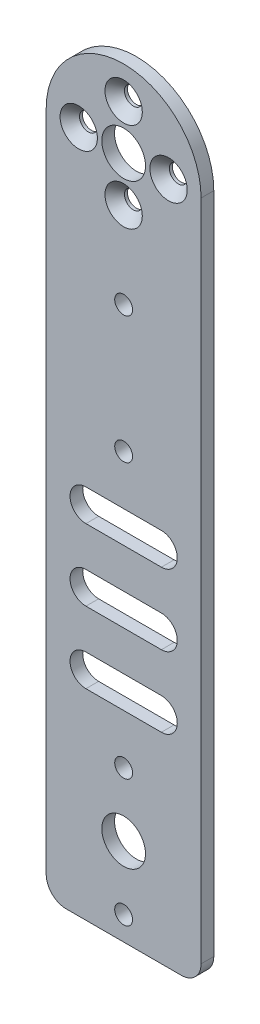
ISO-10303-21;
HEADER;
FILE_DESCRIPTION(('STEP AP214'),'2;1');
FILE_NAME('part.step','',(''),(''),'','','');
FILE_SCHEMA(('AUTOMOTIVE_DESIGN { 1 0 10303 214 1 1 1 1 }'));
ENDSEC;
DATA;
#1=APPLICATION_CONTEXT('core data for automotive mechanical design processes');
#2=APPLICATION_PROTOCOL_DEFINITION('international standard','automotive_design',2000,#1);
#3=PRODUCT_CONTEXT('',#1,'mechanical');
#4=PRODUCT('Part','Part','',(#3));
#5=PRODUCT_RELATED_PRODUCT_CATEGORY('part','',(#4));
#6=PRODUCT_DEFINITION_FORMATION('','',#4);
#7=PRODUCT_DEFINITION_CONTEXT('part definition',#1,'design');
#8=PRODUCT_DEFINITION('design','',#6,#7);
#9=PRODUCT_DEFINITION_SHAPE('','',#8);
#10=(LENGTH_UNIT() NAMED_UNIT(*) SI_UNIT(.MILLI.,.METRE.));
#11=(NAMED_UNIT(*) PLANE_ANGLE_UNIT() SI_UNIT($,.RADIAN.));
#12=(NAMED_UNIT(*) SI_UNIT($,.STERADIAN.) SOLID_ANGLE_UNIT());
#13=UNCERTAINTY_MEASURE_WITH_UNIT(LENGTH_MEASURE(1.E-05),#10,'distance_accuracy_value','');
#14=(GEOMETRIC_REPRESENTATION_CONTEXT(3) GLOBAL_UNCERTAINTY_ASSIGNED_CONTEXT((#13)) GLOBAL_UNIT_ASSIGNED_CONTEXT((#10,
#11,#12)) REPRESENTATION_CONTEXT('',''));
#15=CARTESIAN_POINT('',(0.,0.,0.));
#16=DIRECTION('',(0.,0.,1.));
#17=DIRECTION('',(1.,0.,0.));
#18=AXIS2_PLACEMENT_3D('',#15,#16,#17);
#19=CARTESIAN_POINT('',(0.,11.3137084989848,18.2));
#20=DIRECTION('',(0.,0.,-1.));
#21=DIRECTION('',(-1.,0.,0.));
#22=AXIS2_PLACEMENT_3D('',#19,#20,#21);
#23=CYLINDRICAL_SURFACE('',#22,2.25);
#24=CARTESIAN_POINT('',(0.,11.3137084989848,15.));
#25=DIRECTION('',(0.,0.,1.));
#26=DIRECTION('',(1.,0.,0.));
#27=AXIS2_PLACEMENT_3D('',#24,#25,#26);
#28=CIRCLE('',#27,2.25);
#29=CARTESIAN_POINT('',(2.25,11.3137084989848,15.));
#30=VERTEX_POINT('',#29);
#31=EDGE_CURVE('E378',#30,#30,#28,.T.);
#32=ORIENTED_EDGE('',*,*,#31,.F.);
#33=EDGE_LOOP('',(#32));
#34=FACE_BOUND('',#33,.T.);
#35=CARTESIAN_POINT('',(0.,11.3137084989848,15.75));
#36=DIRECTION('',(0.,0.,1.));
#37=DIRECTION('',(1.,0.,0.));
#38=AXIS2_PLACEMENT_3D('',#35,#36,#37);
#39=CIRCLE('',#38,2.25);
#40=CARTESIAN_POINT('',(2.25,11.3137084989848,15.75));
#41=VERTEX_POINT('',#40);
#42=EDGE_CURVE('E305',#41,#41,#39,.T.);
#43=ORIENTED_EDGE('',*,*,#42,.T.);
#44=EDGE_LOOP('',(#43));
#45=FACE_BOUND('',#44,.T.);
#46=ADVANCED_FACE('F42',(#34,#45),#23,.F.);
#47=CARTESIAN_POINT('',(11.3137084989848,1.17788108312706E-13,18.2));
#48=DIRECTION('',(0.,0.,-1.));
#49=DIRECTION('',(-1.,0.,0.));
#50=AXIS2_PLACEMENT_3D('',#47,#48,#49);
#51=CYLINDRICAL_SURFACE('',#50,2.25);
#52=CARTESIAN_POINT('',(11.3137084989848,1.17788108312706E-13,15.));
#53=DIRECTION('',(0.,0.,1.));
#54=DIRECTION('',(1.,0.,0.));
#55=AXIS2_PLACEMENT_3D('',#52,#53,#54);
#56=CIRCLE('',#55,2.25);
#57=CARTESIAN_POINT('',(13.5637084989848,1.17788108312706E-13,15.));
#58=VERTEX_POINT('',#57);
#59=EDGE_CURVE('E367',#58,#58,#56,.T.);
#60=ORIENTED_EDGE('',*,*,#59,.F.);
#61=EDGE_LOOP('',(#60));
#62=FACE_BOUND('',#61,.T.);
#63=CARTESIAN_POINT('',(11.3137084989848,1.17788108312706E-13,15.75));
#64=DIRECTION('',(0.,0.,1.));
#65=DIRECTION('',(1.,0.,0.));
#66=AXIS2_PLACEMENT_3D('',#63,#64,#65);
#67=CIRCLE('',#66,2.25);
#68=CARTESIAN_POINT('',(13.5637084989848,1.17788108312706E-13,15.75));
#69=VERTEX_POINT('',#68);
#70=EDGE_CURVE('E313',#69,#69,#67,.T.);
#71=ORIENTED_EDGE('',*,*,#70,.T.);
#72=EDGE_LOOP('',(#71));
#73=FACE_BOUND('',#72,.T.);
#74=ADVANCED_FACE('F494',(#62,#73),#51,.F.);
#75=CARTESIAN_POINT('',(0.,-11.3137084989848,18.2));
#76=DIRECTION('',(0.,0.,-1.));
#77=DIRECTION('',(-1.,0.,0.));
#78=AXIS2_PLACEMENT_3D('',#75,#76,#77);
#79=CYLINDRICAL_SURFACE('',#78,2.25);
#80=CARTESIAN_POINT('',(0.,-11.3137084989848,15.));
#81=DIRECTION('',(0.,0.,1.));
#82=DIRECTION('',(1.,0.,0.));
#83=AXIS2_PLACEMENT_3D('',#80,#81,#82);
#84=CIRCLE('',#83,2.25);
#85=CARTESIAN_POINT('',(2.25,-11.3137084989848,15.));
#86=VERTEX_POINT('',#85);
#87=EDGE_CURVE('E374',#86,#86,#84,.T.);
#88=ORIENTED_EDGE('',*,*,#87,.F.);
#89=EDGE_LOOP('',(#88));
#90=FACE_BOUND('',#89,.T.);
#91=CARTESIAN_POINT('',(0.,-11.3137084989848,15.75));
#92=DIRECTION('',(0.,0.,1.));
#93=DIRECTION('',(1.,0.,0.));
#94=AXIS2_PLACEMENT_3D('',#91,#92,#93);
#95=CIRCLE('',#94,2.25);
#96=CARTESIAN_POINT('',(2.25,-11.3137084989848,15.75));
#97=VERTEX_POINT('',#96);
#98=EDGE_CURVE('E321',#97,#97,#95,.T.);
#99=ORIENTED_EDGE('',*,*,#98,.T.);
#100=EDGE_LOOP('',(#99));
#101=FACE_BOUND('',#100,.T.);
#102=ADVANCED_FACE('F500',(#90,#101),#79,.F.);
#103=CARTESIAN_POINT('',(-11.3137084989848,0.,18.2));
#104=DIRECTION('',(0.,0.,-1.));
#105=DIRECTION('',(-1.,0.,0.));
#106=AXIS2_PLACEMENT_3D('',#103,#104,#105);
#107=CYLINDRICAL_SURFACE('',#106,2.25);
#108=CARTESIAN_POINT('',(-11.3137084989848,0.,15.));
#109=DIRECTION('',(0.,0.,1.));
#110=DIRECTION('',(1.,0.,0.));
#111=AXIS2_PLACEMENT_3D('',#108,#109,#110);
#112=CIRCLE('',#111,2.25);
#113=CARTESIAN_POINT('',(-9.06370849898476,0.,15.));
#114=VERTEX_POINT('',#113);
#115=EDGE_CURVE('E358',#114,#114,#112,.T.);
#116=ORIENTED_EDGE('',*,*,#115,.F.);
#117=EDGE_LOOP('',(#116));
#118=FACE_BOUND('',#117,.T.);
#119=CARTESIAN_POINT('',(-11.3137084989848,0.,15.75));
#120=DIRECTION('',(0.,0.,1.));
#121=DIRECTION('',(1.,0.,0.));
#122=AXIS2_PLACEMENT_3D('',#119,#120,#121);
#123=CIRCLE('',#122,2.25);
#124=CARTESIAN_POINT('',(-9.06370849898476,0.,15.75));
#125=VERTEX_POINT('',#124);
#126=EDGE_CURVE('E329',#125,#125,#123,.T.);
#127=ORIENTED_EDGE('',*,*,#126,.T.);
#128=EDGE_LOOP('',(#127));
#129=FACE_BOUND('',#128,.T.);
#130=ADVANCED_FACE('F508',(#118,#129),#107,.F.);
#131=CARTESIAN_POINT('',(0.,0.,18.2));
#132=DIRECTION('',(0.,0.,1.));
#133=DIRECTION('',(1.,0.,0.));
#134=AXIS2_PLACEMENT_3D('',#131,#132,#133);
#135=PLANE('',#134);
#136=CARTESIAN_POINT('',(-9.49999999999999,-117.5,18.2));
#137=DIRECTION('',(0.,0.,-1.));
#138=DIRECTION('',(-1.,0.,0.));
#139=AXIS2_PLACEMENT_3D('',#136,#137,#138);
#140=CIRCLE('',#139,4.00000000000002);
#141=CARTESIAN_POINT('',(-9.49999999999999,-121.5,18.2));
#142=VERTEX_POINT('',#141);
#143=CARTESIAN_POINT('',(-9.49999999999999,-113.5,18.2));
#144=VERTEX_POINT('',#143);
#145=EDGE_CURVE('E214',#142,#144,#140,.T.);
#146=ORIENTED_EDGE('',*,*,#145,.T.);
#147=DIRECTION('',(-1.,0.,0.));
#148=VECTOR('',#147,1.);
#149=CARTESIAN_POINT('',(0.,-113.5,18.2));
#150=LINE('',#149,#148);
#151=CARTESIAN_POINT('',(9.49999999999999,-113.5,18.2));
#152=VERTEX_POINT('',#151);
#153=EDGE_CURVE('E179',#152,#144,#150,.T.);
#154=ORIENTED_EDGE('',*,*,#153,.F.);
#155=CARTESIAN_POINT('',(9.49999999999999,-117.5,18.2));
#156=DIRECTION('',(0.,0.,-1.));
#157=DIRECTION('',(-1.,0.,0.));
#158=AXIS2_PLACEMENT_3D('',#155,#156,#157);
#159=CIRCLE('',#158,4.00000000000002);
#160=CARTESIAN_POINT('',(9.49999999999999,-121.5,18.2));
#161=VERTEX_POINT('',#160);
#162=EDGE_CURVE('E58',#152,#161,#159,.T.);
#163=ORIENTED_EDGE('',*,*,#162,.T.);
#164=DIRECTION('',(-1.,0.,0.));
#165=VECTOR('',#164,1.);
#166=CARTESIAN_POINT('',(0.,-121.5,18.2));
#167=LINE('',#166,#165);
#168=EDGE_CURVE('E207',#161,#142,#167,.T.);
#169=ORIENTED_EDGE('',*,*,#168,.T.);
#170=EDGE_LOOP('',(#146,#154,#163,#169));
#171=FACE_BOUND('',#170,.T.);
#172=CARTESIAN_POINT('',(-9.49999999999999,-81.5,18.2));
#173=DIRECTION('',(0.,0.,-1.));
#174=DIRECTION('',(-1.,0.,0.));
#175=AXIS2_PLACEMENT_3D('',#172,#173,#174);
#176=CIRCLE('',#175,4.00000000000002);
#177=CARTESIAN_POINT('',(-9.49999999999999,-85.5,18.2));
#178=VERTEX_POINT('',#177);
#179=CARTESIAN_POINT('',(-9.49999999999999,-77.5,18.2));
#180=VERTEX_POINT('',#179);
#181=EDGE_CURVE('E180',#178,#180,#176,.T.);
#182=ORIENTED_EDGE('',*,*,#181,.T.);
#183=DIRECTION('',(-1.,0.,0.));
#184=VECTOR('',#183,1.);
#185=CARTESIAN_POINT('',(0.,-77.5,18.2));
#186=LINE('',#185,#184);
#187=CARTESIAN_POINT('',(9.49999999999999,-77.5,18.2));
#188=VERTEX_POINT('',#187);
#189=EDGE_CURVE('E223',#188,#180,#186,.T.);
#190=ORIENTED_EDGE('',*,*,#189,.F.);
#191=CARTESIAN_POINT('',(9.49999999999999,-81.5,18.2));
#192=DIRECTION('',(0.,0.,-1.));
#193=DIRECTION('',(-1.,0.,0.));
#194=AXIS2_PLACEMENT_3D('',#191,#192,#193);
#195=CIRCLE('',#194,4.00000000000002);
#196=CARTESIAN_POINT('',(9.49999999999999,-85.5,18.2));
#197=VERTEX_POINT('',#196);
#198=EDGE_CURVE('E66',#188,#197,#195,.T.);
#199=ORIENTED_EDGE('',*,*,#198,.T.);
#200=DIRECTION('',(-1.,0.,0.));
#201=VECTOR('',#200,1.);
#202=CARTESIAN_POINT('',(0.,-85.5,18.2));
#203=LINE('',#202,#201);
#204=EDGE_CURVE('E249',#197,#178,#203,.T.);
#205=ORIENTED_EDGE('',*,*,#204,.T.);
#206=EDGE_LOOP('',(#182,#190,#199,#205));
#207=FACE_BOUND('',#206,.T.);
#208=CARTESIAN_POINT('',(-9.49999999999999,-99.5,18.2));
#209=DIRECTION('',(0.,0.,-1.));
#210=DIRECTION('',(-1.,0.,0.));
#211=AXIS2_PLACEMENT_3D('',#208,#209,#210);
#212=CIRCLE('',#211,4.00000000000002);
#213=CARTESIAN_POINT('',(-9.49999999999999,-103.5,18.2));
#214=VERTEX_POINT('',#213);
#215=CARTESIAN_POINT('',(-9.49999999999999,-95.5,18.2));
#216=VERTEX_POINT('',#215);
#217=EDGE_CURVE('E259',#214,#216,#212,.T.);
#218=ORIENTED_EDGE('',*,*,#217,.T.);
#219=DIRECTION('',(-1.,0.,0.));
#220=VECTOR('',#219,1.);
#221=CARTESIAN_POINT('',(0.,-95.5,18.2));
#222=LINE('',#221,#220);
#223=CARTESIAN_POINT('',(9.49999999999999,-95.5,18.2));
#224=VERTEX_POINT('',#223);
#225=EDGE_CURVE('E263',#224,#216,#222,.T.);
#226=ORIENTED_EDGE('',*,*,#225,.F.);
#227=CARTESIAN_POINT('',(9.49999999999999,-99.5,18.2));
#228=DIRECTION('',(0.,0.,-1.));
#229=DIRECTION('',(-1.,0.,0.));
#230=AXIS2_PLACEMENT_3D('',#227,#228,#229);
#231=CIRCLE('',#230,4.00000000000002);
#232=CARTESIAN_POINT('',(9.49999999999999,-103.5,18.2));
#233=VERTEX_POINT('',#232);
#234=EDGE_CURVE('E267',#224,#233,#231,.T.);
#235=ORIENTED_EDGE('',*,*,#234,.T.);
#236=DIRECTION('',(-1.,0.,0.));
#237=VECTOR('',#236,1.);
#238=CARTESIAN_POINT('',(0.,-103.5,18.2));
#239=LINE('',#238,#237);
#240=EDGE_CURVE('E271',#233,#214,#239,.T.);
#241=ORIENTED_EDGE('',*,*,#240,.T.);
#242=EDGE_LOOP('',(#218,#226,#235,#241));
#243=FACE_BOUND('',#242,.T.);
#244=CARTESIAN_POINT('',(0.,11.3137084989848,18.2));
#245=DIRECTION('',(0.,0.,1.));
#246=DIRECTION('',(1.,0.,0.));
#247=AXIS2_PLACEMENT_3D('',#244,#245,#246);
#248=CIRCLE('',#247,4.7);
#249=CARTESIAN_POINT('',(4.7,11.3137084989848,18.2));
#250=VERTEX_POINT('',#249);
#251=EDGE_CURVE('E292',#250,#250,#248,.T.);
#252=ORIENTED_EDGE('',*,*,#251,.F.);
#253=EDGE_LOOP('',(#252));
#254=FACE_BOUND('',#253,.T.);
#255=CARTESIAN_POINT('',(11.3137084989848,1.17788108312706E-13,18.2));
#256=DIRECTION('',(0.,0.,1.));
#257=DIRECTION('',(1.,0.,0.));
#258=AXIS2_PLACEMENT_3D('',#255,#256,#257);
#259=CIRCLE('',#258,4.7);
#260=CARTESIAN_POINT('',(16.0137084989848,1.17788108312706E-13,18.2));
#261=VERTEX_POINT('',#260);
#262=EDGE_CURVE('E309',#261,#261,#259,.T.);
#263=ORIENTED_EDGE('',*,*,#262,.F.);
#264=EDGE_LOOP('',(#263));
#265=FACE_BOUND('',#264,.T.);
#266=CARTESIAN_POINT('',(0.,-11.3137084989848,18.2));
#267=DIRECTION('',(0.,0.,1.));
#268=DIRECTION('',(1.,0.,0.));
#269=AXIS2_PLACEMENT_3D('',#266,#267,#268);
#270=CIRCLE('',#269,4.7);
#271=CARTESIAN_POINT('',(4.7,-11.3137084989848,18.2));
#272=VERTEX_POINT('',#271);
#273=EDGE_CURVE('E317',#272,#272,#270,.T.);
#274=ORIENTED_EDGE('',*,*,#273,.F.);
#275=EDGE_LOOP('',(#274));
#276=FACE_BOUND('',#275,.T.);
#277=CARTESIAN_POINT('',(-11.3137084989848,0.,18.2));
#278=DIRECTION('',(0.,0.,1.));
#279=DIRECTION('',(1.,0.,0.));
#280=AXIS2_PLACEMENT_3D('',#277,#278,#279);
#281=CIRCLE('',#280,4.7);
#282=CARTESIAN_POINT('',(-6.61370849898476,0.,18.2));
#283=VERTEX_POINT('',#282);
#284=EDGE_CURVE('E325',#283,#283,#281,.T.);
#285=ORIENTED_EDGE('',*,*,#284,.F.);
#286=EDGE_LOOP('',(#285));
#287=FACE_BOUND('',#286,.T.);
#288=CARTESIAN_POINT('',(1.75008788808204E-13,-166.,18.2));
#289=DIRECTION('',(0.,0.,1.));
#290=DIRECTION('',(1.,0.,0.));
#291=AXIS2_PLACEMENT_3D('',#288,#289,#290);
#292=CIRCLE('',#291,2.25);
#293=CARTESIAN_POINT('',(2.25000000000018,-166.,18.2));
#294=VERTEX_POINT('',#293);
#295=EDGE_CURVE('E334',#294,#294,#292,.F.);
#296=ORIENTED_EDGE('',*,*,#295,.T.);
#297=EDGE_LOOP('',(#296));
#298=FACE_BOUND('',#297,.T.);
#299=CARTESIAN_POINT('',(1.75008788808204E-13,-134.,18.2));
#300=DIRECTION('',(0.,0.,1.));
#301=DIRECTION('',(1.,0.,0.));
#302=AXIS2_PLACEMENT_3D('',#299,#300,#301);
#303=CIRCLE('',#302,2.25);
#304=CARTESIAN_POINT('',(2.25000000000018,-134.,18.2));
#305=VERTEX_POINT('',#304);
#306=EDGE_CURVE('E339',#305,#305,#303,.F.);
#307=ORIENTED_EDGE('',*,*,#306,.T.);
#308=EDGE_LOOP('',(#307));
#309=FACE_BOUND('',#308,.T.);
#310=CARTESIAN_POINT('',(-2.38722918678201E-13,-65.0000000000001,18.2));
#311=DIRECTION('',(0.,0.,1.));
#312=DIRECTION('',(1.,0.,0.));
#313=AXIS2_PLACEMENT_3D('',#310,#311,#312);
#314=CIRCLE('',#313,2.25);
#315=CARTESIAN_POINT('',(2.24999999999976,-65.0000000000001,18.2));
#316=VERTEX_POINT('',#315);
#317=EDGE_CURVE('E344',#316,#316,#314,.F.);
#318=ORIENTED_EDGE('',*,*,#317,.T.);
#319=EDGE_LOOP('',(#318));
#320=FACE_BOUND('',#319,.T.);
#321=CARTESIAN_POINT('',(0.,-33.,18.2));
#322=DIRECTION('',(0.,0.,1.));
#323=DIRECTION('',(1.,0.,0.));
#324=AXIS2_PLACEMENT_3D('',#321,#322,#323);
#325=CIRCLE('',#324,2.25);
#326=CARTESIAN_POINT('',(2.25,-33.,18.2));
#327=VERTEX_POINT('',#326);
#328=EDGE_CURVE('E349',#327,#327,#325,.T.);
#329=ORIENTED_EDGE('',*,*,#328,.F.);
#330=EDGE_LOOP('',(#329));
#331=FACE_BOUND('',#330,.T.);
#332=CARTESIAN_POINT('',(0.,-150.,18.2));
#333=DIRECTION('',(0.,0.,1.));
#334=DIRECTION('',(1.,0.,0.));
#335=AXIS2_PLACEMENT_3D('',#332,#333,#334);
#336=CIRCLE('',#335,5.5);
#337=CARTESIAN_POINT('',(5.5,-150.,18.2));
#338=VERTEX_POINT('',#337);
#339=EDGE_CURVE('E354',#338,#338,#336,.F.);
#340=ORIENTED_EDGE('',*,*,#339,.T.);
#341=EDGE_LOOP('',(#340));
#342=FACE_BOUND('',#341,.T.);
#343=CARTESIAN_POINT('',(0.,0.,18.2));
#344=DIRECTION('',(0.,0.,1.));
#345=DIRECTION('',(1.,0.,0.));
#346=AXIS2_PLACEMENT_3D('',#343,#344,#345);
#347=CIRCLE('',#346,5.5);
#348=CARTESIAN_POINT('',(5.5,0.,18.2));
#349=VERTEX_POINT('',#348);
#350=EDGE_CURVE('E363',#349,#349,#347,.T.);
#351=ORIENTED_EDGE('',*,*,#350,.F.);
#352=EDGE_LOOP('',(#351));
#353=FACE_BOUND('',#352,.T.);
#354=DIRECTION('',(1.,0.,0.));
#355=VECTOR('',#354,1.);
#356=CARTESIAN_POINT('',(-19.5,-172.,18.2));
#357=LINE('',#356,#355);
#358=CARTESIAN_POINT('',(-14.5,-172.,18.2));
#359=VERTEX_POINT('',#358);
#360=CARTESIAN_POINT('',(14.5,-172.,18.2));
#361=VERTEX_POINT('',#360);
#362=EDGE_CURVE('E392',#359,#361,#357,.T.);
#363=ORIENTED_EDGE('',*,*,#362,.T.);
#364=CARTESIAN_POINT('',(14.5,-167.,18.2));
#365=DIRECTION('',(0.,0.,1.));
#366=DIRECTION('',(1.,0.,0.));
#367=AXIS2_PLACEMENT_3D('',#364,#365,#366);
#368=CIRCLE('',#367,5.);
#369=CARTESIAN_POINT('',(19.5,-167.,18.2));
#370=VERTEX_POINT('',#369);
#371=EDGE_CURVE('E51',#361,#370,#368,.T.);
#372=ORIENTED_EDGE('',*,*,#371,.T.);
#373=DIRECTION('',(0.,1.,0.));
#374=VECTOR('',#373,1.);
#375=CARTESIAN_POINT('',(19.5,-172.,18.2));
#376=LINE('',#375,#374);
#377=CARTESIAN_POINT('',(19.5,0.,18.2));
#378=VERTEX_POINT('',#377);
#379=EDGE_CURVE('E396',#370,#378,#376,.T.);
#380=ORIENTED_EDGE('',*,*,#379,.T.);
#381=CARTESIAN_POINT('',(0.,0.,18.2));
#382=DIRECTION('',(0.,0.,1.));
#383=DIRECTION('',(1.,0.,0.));
#384=AXIS2_PLACEMENT_3D('',#381,#382,#383);
#385=CIRCLE('',#384,19.5);
#386=CARTESIAN_POINT('',(-19.5,0.,18.2));
#387=VERTEX_POINT('',#386);
#388=EDGE_CURVE('E383',#378,#387,#385,.T.);
#389=ORIENTED_EDGE('',*,*,#388,.T.);
#390=DIRECTION('',(0.,-1.,0.));
#391=VECTOR('',#390,1.);
#392=CARTESIAN_POINT('',(-19.5,0.,18.2));
#393=LINE('',#392,#391);
#394=CARTESIAN_POINT('',(-19.5,-167.,18.2));
#395=VERTEX_POINT('',#394);
#396=EDGE_CURVE('E387',#387,#395,#393,.T.);
#397=ORIENTED_EDGE('',*,*,#396,.T.);
#398=CARTESIAN_POINT('',(-14.5,-167.,18.2));
#399=DIRECTION('',(0.,0.,1.));
#400=DIRECTION('',(1.,0.,0.));
#401=AXIS2_PLACEMENT_3D('',#398,#399,#400);
#402=CIRCLE('',#401,5.);
#403=EDGE_CURVE('E452',#395,#359,#402,.T.);
#404=ORIENTED_EDGE('',*,*,#403,.T.);
#405=EDGE_LOOP('',(#363,#372,#380,#389,#397,#404));
#406=FACE_BOUND('',#405,.T.);
#407=ADVANCED_FACE('F458',(#171,#207,#243,#254,#265,#276,#287,#298,#309,#320,#331,#342,#353,
#406),#135,.T.);
#408=CARTESIAN_POINT('',(0.,0.,15.));
#409=DIRECTION('',(0.,0.,1.));
#410=DIRECTION('',(1.,0.,0.));
#411=AXIS2_PLACEMENT_3D('',#408,#409,#410);
#412=PLANE('',#411);
#413=DIRECTION('',(-1.,0.,0.));
#414=VECTOR('',#413,1.);
#415=CARTESIAN_POINT('',(0.,-113.5,15.));
#416=LINE('',#415,#414);
#417=CARTESIAN_POINT('',(9.49999999999999,-113.5,15.));
#418=VERTEX_POINT('',#417);
#419=CARTESIAN_POINT('',(-9.49999999999999,-113.5,15.));
#420=VERTEX_POINT('',#419);
#421=EDGE_CURVE('E169',#418,#420,#416,.T.);
#422=ORIENTED_EDGE('',*,*,#421,.T.);
#423=CARTESIAN_POINT('',(-9.49999999999999,-117.5,15.));
#424=DIRECTION('',(0.,0.,-1.));
#425=DIRECTION('',(-1.,0.,0.));
#426=AXIS2_PLACEMENT_3D('',#423,#424,#425);
#427=CIRCLE('',#426,4.00000000000002);
#428=CARTESIAN_POINT('',(-9.49999999999999,-121.5,15.));
#429=VERTEX_POINT('',#428);
#430=EDGE_CURVE('E211',#429,#420,#427,.T.);
#431=ORIENTED_EDGE('',*,*,#430,.F.);
#432=DIRECTION('',(-1.,0.,0.));
#433=VECTOR('',#432,1.);
#434=CARTESIAN_POINT('',(0.,-121.5,15.));
#435=LINE('',#434,#433);
#436=CARTESIAN_POINT('',(9.49999999999999,-121.5,15.));
#437=VERTEX_POINT('',#436);
#438=EDGE_CURVE('E190',#437,#429,#435,.T.);
#439=ORIENTED_EDGE('',*,*,#438,.F.);
#440=CARTESIAN_POINT('',(9.49999999999999,-117.5,15.));
#441=DIRECTION('',(0.,0.,-1.));
#442=DIRECTION('',(-1.,0.,0.));
#443=AXIS2_PLACEMENT_3D('',#440,#441,#442);
#444=CIRCLE('',#443,4.00000000000002);
#445=EDGE_CURVE('E183',#418,#437,#444,.T.);
#446=ORIENTED_EDGE('',*,*,#445,.F.);
#447=EDGE_LOOP('',(#422,#431,#439,#446));
#448=FACE_BOUND('',#447,.T.);
#449=DIRECTION('',(-1.,0.,0.));
#450=VECTOR('',#449,1.);
#451=CARTESIAN_POINT('',(0.,-77.5,15.));
#452=LINE('',#451,#450);
#453=CARTESIAN_POINT('',(9.49999999999999,-77.5,15.));
#454=VERTEX_POINT('',#453);
#455=CARTESIAN_POINT('',(-9.49999999999999,-77.5,15.));
#456=VERTEX_POINT('',#455);
#457=EDGE_CURVE('E219',#454,#456,#452,.T.);
#458=ORIENTED_EDGE('',*,*,#457,.T.);
#459=CARTESIAN_POINT('',(-9.49999999999999,-81.5,15.));
#460=DIRECTION('',(0.,0.,-1.));
#461=DIRECTION('',(-1.,0.,0.));
#462=AXIS2_PLACEMENT_3D('',#459,#460,#461);
#463=CIRCLE('',#462,4.00000000000002);
#464=CARTESIAN_POINT('',(-9.49999999999999,-85.5,15.));
#465=VERTEX_POINT('',#464);
#466=EDGE_CURVE('E253',#465,#456,#463,.T.);
#467=ORIENTED_EDGE('',*,*,#466,.F.);
#468=DIRECTION('',(-1.,0.,0.));
#469=VECTOR('',#468,1.);
#470=CARTESIAN_POINT('',(0.,-85.5,15.));
#471=LINE('',#470,#469);
#472=CARTESIAN_POINT('',(9.49999999999999,-85.5,15.));
#473=VERTEX_POINT('',#472);
#474=EDGE_CURVE('E242',#473,#465,#471,.T.);
#475=ORIENTED_EDGE('',*,*,#474,.F.);
#476=CARTESIAN_POINT('',(9.49999999999999,-81.5,15.));
#477=DIRECTION('',(0.,0.,-1.));
#478=DIRECTION('',(-1.,0.,0.));
#479=AXIS2_PLACEMENT_3D('',#476,#477,#478);
#480=CIRCLE('',#479,4.00000000000002);
#481=EDGE_CURVE('E233',#454,#473,#480,.T.);
#482=ORIENTED_EDGE('',*,*,#481,.F.);
#483=EDGE_LOOP('',(#458,#467,#475,#482));
#484=FACE_BOUND('',#483,.T.);
#485=DIRECTION('',(-1.,0.,0.));
#486=VECTOR('',#485,1.);
#487=CARTESIAN_POINT('',(0.,-95.5,15.));
#488=LINE('',#487,#486);
#489=CARTESIAN_POINT('',(9.49999999999999,-95.5,15.));
#490=VERTEX_POINT('',#489);
#491=CARTESIAN_POINT('',(-9.49999999999999,-95.5,15.));
#492=VERTEX_POINT('',#491);
#493=EDGE_CURVE('E278',#490,#492,#488,.T.);
#494=ORIENTED_EDGE('',*,*,#493,.T.);
#495=CARTESIAN_POINT('',(-9.49999999999999,-99.5,15.));
#496=DIRECTION('',(0.,0.,-1.));
#497=DIRECTION('',(-1.,0.,0.));
#498=AXIS2_PLACEMENT_3D('',#495,#496,#497);
#499=CIRCLE('',#498,4.00000000000002);
#500=CARTESIAN_POINT('',(-9.49999999999999,-103.5,15.));
#501=VERTEX_POINT('',#500);
#502=EDGE_CURVE('E218',#501,#492,#499,.T.);
#503=ORIENTED_EDGE('',*,*,#502,.F.);
#504=DIRECTION('',(-1.,0.,0.));
#505=VECTOR('',#504,1.);
#506=CARTESIAN_POINT('',(0.,-103.5,15.));
#507=LINE('',#506,#505);
#508=CARTESIAN_POINT('',(9.49999999999999,-103.5,15.));
#509=VERTEX_POINT('',#508);
#510=EDGE_CURVE('E264',#509,#501,#507,.T.);
#511=ORIENTED_EDGE('',*,*,#510,.F.);
#512=CARTESIAN_POINT('',(9.49999999999999,-99.5,15.));
#513=DIRECTION('',(0.,0.,-1.));
#514=DIRECTION('',(-1.,0.,0.));
#515=AXIS2_PLACEMENT_3D('',#512,#513,#514);
#516=CIRCLE('',#515,4.00000000000002);
#517=EDGE_CURVE('E282',#490,#509,#516,.T.);
#518=ORIENTED_EDGE('',*,*,#517,.F.);
#519=EDGE_LOOP('',(#494,#503,#511,#518));
#520=FACE_BOUND('',#519,.T.);
#521=CARTESIAN_POINT('',(1.4149056795531E-13,-166.,15.));
#522=DIRECTION('',(0.,0.,1.));
#523=DIRECTION('',(1.,0.,0.));
#524=AXIS2_PLACEMENT_3D('',#521,#522,#523);
#525=CIRCLE('',#524,2.25);
#526=CARTESIAN_POINT('',(2.25000000000015,-166.,15.));
#527=VERTEX_POINT('',#526);
#528=EDGE_CURVE('E333',#527,#527,#525,.F.);
#529=ORIENTED_EDGE('',*,*,#528,.F.);
#530=EDGE_LOOP('',(#529));
#531=FACE_BOUND('',#530,.T.);
#532=CARTESIAN_POINT('',(1.4149056795531E-13,-134.,15.));
#533=DIRECTION('',(0.,0.,1.));
#534=DIRECTION('',(1.,0.,0.));
#535=AXIS2_PLACEMENT_3D('',#532,#533,#534);
#536=CIRCLE('',#535,2.25);
#537=CARTESIAN_POINT('',(2.25000000000015,-134.,15.));
#538=VERTEX_POINT('',#537);
#539=EDGE_CURVE('E338',#538,#538,#536,.F.);
#540=ORIENTED_EDGE('',*,*,#539,.F.);
#541=EDGE_LOOP('',(#540));
#542=FACE_BOUND('',#541,.T.);
#543=CARTESIAN_POINT('',(-2.27550178393903E-13,-65.,15.));
#544=DIRECTION('',(0.,0.,1.));
#545=DIRECTION('',(1.,0.,0.));
#546=AXIS2_PLACEMENT_3D('',#543,#544,#545);
#547=CIRCLE('',#546,2.25);
#548=CARTESIAN_POINT('',(2.24999999999978,-65.,15.));
#549=VERTEX_POINT('',#548);
#550=EDGE_CURVE('E343',#549,#549,#547,.F.);
#551=ORIENTED_EDGE('',*,*,#550,.F.);
#552=EDGE_LOOP('',(#551));
#553=FACE_BOUND('',#552,.T.);
#554=CARTESIAN_POINT('',(0.,-33.,15.));
#555=DIRECTION('',(0.,0.,1.));
#556=DIRECTION('',(1.,0.,0.));
#557=AXIS2_PLACEMENT_3D('',#554,#555,#556);
#558=CIRCLE('',#557,2.25);
#559=CARTESIAN_POINT('',(2.25,-33.,15.));
#560=VERTEX_POINT('',#559);
#561=EDGE_CURVE('E348',#560,#560,#558,.T.);
#562=ORIENTED_EDGE('',*,*,#561,.T.);
#563=EDGE_LOOP('',(#562));
#564=FACE_BOUND('',#563,.T.);
#565=CARTESIAN_POINT('',(0.,-150.,15.));
#566=DIRECTION('',(0.,0.,1.));
#567=DIRECTION('',(1.,0.,0.));
#568=AXIS2_PLACEMENT_3D('',#565,#566,#567);
#569=CIRCLE('',#568,5.5);
#570=CARTESIAN_POINT('',(5.5,-150.,15.));
#571=VERTEX_POINT('',#570);
#572=EDGE_CURVE('E353',#571,#571,#569,.F.);
#573=ORIENTED_EDGE('',*,*,#572,.F.);
#574=EDGE_LOOP('',(#573));
#575=FACE_BOUND('',#574,.T.);
#576=DIRECTION('',(0.,1.,0.));
#577=VECTOR('',#576,1.);
#578=CARTESIAN_POINT('',(19.5,-172.,15.));
#579=LINE('',#578,#577);
#580=CARTESIAN_POINT('',(19.5,-167.,15.));
#581=VERTEX_POINT('',#580);
#582=CARTESIAN_POINT('',(19.5,0.,15.));
#583=VERTEX_POINT('',#582);
#584=EDGE_CURVE('E388',#581,#583,#579,.T.);
#585=ORIENTED_EDGE('',*,*,#584,.F.);
#586=CARTESIAN_POINT('',(14.5,-167.,15.));
#587=DIRECTION('',(0.,0.,1.));
#588=DIRECTION('',(1.,0.,0.));
#589=AXIS2_PLACEMENT_3D('',#586,#587,#588);
#590=CIRCLE('',#589,5.);
#591=CARTESIAN_POINT('',(14.5,-172.,15.));
#592=VERTEX_POINT('',#591);
#593=EDGE_CURVE('E442',#581,#592,#590,.F.);
#594=ORIENTED_EDGE('',*,*,#593,.T.);
#595=DIRECTION('',(1.,0.,0.));
#596=VECTOR('',#595,1.);
#597=CARTESIAN_POINT('',(-19.5,-172.,15.));
#598=LINE('',#597,#596);
#599=CARTESIAN_POINT('',(-14.5,-172.,15.));
#600=VERTEX_POINT('',#599);
#601=EDGE_CURVE('E407',#600,#592,#598,.T.);
#602=ORIENTED_EDGE('',*,*,#601,.F.);
#603=CARTESIAN_POINT('',(-14.5,-167.,15.));
#604=DIRECTION('',(0.,0.,1.));
#605=DIRECTION('',(1.,0.,0.));
#606=AXIS2_PLACEMENT_3D('',#603,#604,#605);
#607=CIRCLE('',#606,5.);
#608=CARTESIAN_POINT('',(-19.5,-167.,15.));
#609=VERTEX_POINT('',#608);
#610=EDGE_CURVE('E439',#600,#609,#607,.F.);
#611=ORIENTED_EDGE('',*,*,#610,.T.);
#612=DIRECTION('',(0.,-1.,0.));
#613=VECTOR('',#612,1.);
#614=CARTESIAN_POINT('',(-19.5,0.,15.));
#615=LINE('',#614,#613);
#616=CARTESIAN_POINT('',(-19.5,0.,15.));
#617=VERTEX_POINT('',#616);
#618=EDGE_CURVE('E403',#617,#609,#615,.T.);
#619=ORIENTED_EDGE('',*,*,#618,.F.);
#620=CARTESIAN_POINT('',(0.,0.,15.));
#621=DIRECTION('',(0.,0.,1.));
#622=DIRECTION('',(1.,0.,0.));
#623=AXIS2_PLACEMENT_3D('',#620,#621,#622);
#624=CIRCLE('',#623,19.5);
#625=EDGE_CURVE('E382',#583,#617,#624,.T.);
#626=ORIENTED_EDGE('',*,*,#625,.F.);
#627=EDGE_LOOP('',(#585,#594,#602,#611,#619,#626));
#628=FACE_BOUND('',#627,.T.);
#629=ORIENTED_EDGE('',*,*,#31,.T.);
#630=EDGE_LOOP('',(#629));
#631=FACE_BOUND('',#630,.T.);
#632=ORIENTED_EDGE('',*,*,#87,.T.);
#633=EDGE_LOOP('',(#632));
#634=FACE_BOUND('',#633,.T.);
#635=ORIENTED_EDGE('',*,*,#59,.T.);
#636=EDGE_LOOP('',(#635));
#637=FACE_BOUND('',#636,.T.);
#638=CARTESIAN_POINT('',(0.,0.,15.));
#639=DIRECTION('',(0.,0.,1.));
#640=DIRECTION('',(1.,0.,0.));
#641=AXIS2_PLACEMENT_3D('',#638,#639,#640);
#642=CIRCLE('',#641,5.5);
#643=CARTESIAN_POINT('',(5.5,0.,15.));
#644=VERTEX_POINT('',#643);
#645=EDGE_CURVE('E362',#644,#644,#642,.T.);
#646=ORIENTED_EDGE('',*,*,#645,.T.);
#647=EDGE_LOOP('',(#646));
#648=FACE_BOUND('',#647,.T.);
#649=ORIENTED_EDGE('',*,*,#115,.T.);
#650=EDGE_LOOP('',(#649));
#651=FACE_BOUND('',#650,.T.);
#652=ADVANCED_FACE('F188',(#448,#484,#520,#531,#542,#553,#564,#575,#628,#631,#634,#637,#648,
#651),#412,.F.);
#653=CARTESIAN_POINT('',(0.,0.,18.2));
#654=DIRECTION('',(0.,0.,-1.));
#655=DIRECTION('',(-1.,0.,0.));
#656=AXIS2_PLACEMENT_3D('',#653,#654,#655);
#657=CYLINDRICAL_SURFACE('',#656,19.5);
#658=ORIENTED_EDGE('',*,*,#625,.T.);
#659=DIRECTION('',(0.,0.,-1.));
#660=VECTOR('',#659,1.);
#661=CARTESIAN_POINT('',(-19.5,0.,18.2));
#662=LINE('',#661,#660);
#663=EDGE_CURVE('E416',#387,#617,#662,.T.);
#664=ORIENTED_EDGE('',*,*,#663,.F.);
#665=ORIENTED_EDGE('',*,*,#388,.F.);
#666=DIRECTION('',(0.,0.,-1.));
#667=VECTOR('',#666,1.);
#668=CARTESIAN_POINT('',(19.5,0.,18.2));
#669=LINE('',#668,#667);
#670=EDGE_CURVE('E399',#378,#583,#669,.T.);
#671=ORIENTED_EDGE('',*,*,#670,.T.);
#672=EDGE_LOOP('',(#658,#664,#665,#671));
#673=FACE_BOUND('',#672,.T.);
#674=ADVANCED_FACE('F483',(#673),#657,.T.);
#675=CARTESIAN_POINT('',(-19.5,0.,18.2));
#676=DIRECTION('',(1.,0.,0.));
#677=DIRECTION('',(0.,1.,0.));
#678=AXIS2_PLACEMENT_3D('',#675,#676,#677);
#679=PLANE('',#678);
#680=ORIENTED_EDGE('',*,*,#618,.T.);
#681=DIRECTION('',(0.,0.,-1.));
#682=VECTOR('',#681,1.);
#683=CARTESIAN_POINT('',(-19.5,-167.,18.2));
#684=LINE('',#683,#682);
#685=EDGE_CURVE('E11',#609,#395,#684,.F.);
#686=ORIENTED_EDGE('',*,*,#685,.T.);
#687=ORIENTED_EDGE('',*,*,#396,.F.);
#688=ORIENTED_EDGE('',*,*,#663,.T.);
#689=EDGE_LOOP('',(#680,#686,#687,#688));
#690=FACE_BOUND('',#689,.T.);
#691=ADVANCED_FACE('F480',(#690),#679,.F.);
#692=CARTESIAN_POINT('',(-19.5,-172.,18.2));
#693=DIRECTION('',(0.,1.,0.));
#694=DIRECTION('',(0.,0.,1.));
#695=AXIS2_PLACEMENT_3D('',#692,#693,#694);
#696=PLANE('',#695);
#697=ORIENTED_EDGE('',*,*,#601,.T.);
#698=DIRECTION('',(0.,0.,-1.));
#699=VECTOR('',#698,1.);
#700=CARTESIAN_POINT('',(14.5,-172.,18.2));
#701=LINE('',#700,#699);
#702=EDGE_CURVE('E449',#592,#361,#701,.F.);
#703=ORIENTED_EDGE('',*,*,#702,.T.);
#704=ORIENTED_EDGE('',*,*,#362,.F.);
#705=DIRECTION('',(0.,0.,-1.));
#706=VECTOR('',#705,1.);
#707=CARTESIAN_POINT('',(-14.5,-172.,18.2));
#708=LINE('',#707,#706);
#709=EDGE_CURVE('E445',#359,#600,#708,.T.);
#710=ORIENTED_EDGE('',*,*,#709,.T.);
#711=EDGE_LOOP('',(#697,#703,#704,#710));
#712=FACE_BOUND('',#711,.T.);
#713=ADVANCED_FACE('F474',(#712),#696,.F.);
#714=CARTESIAN_POINT('',(19.5,-172.,18.2));
#715=DIRECTION('',(-1.,0.,0.));
#716=DIRECTION('',(0.,0.,1.));
#717=AXIS2_PLACEMENT_3D('',#714,#715,#716);
#718=PLANE('',#717);
#719=ORIENTED_EDGE('',*,*,#379,.F.);
#720=DIRECTION('',(0.,0.,-1.));
#721=VECTOR('',#720,1.);
#722=CARTESIAN_POINT('',(19.5,-167.,18.2));
#723=LINE('',#722,#721);
#724=EDGE_CURVE('E420',#370,#581,#723,.T.);
#725=ORIENTED_EDGE('',*,*,#724,.T.);
#726=ORIENTED_EDGE('',*,*,#584,.T.);
#727=ORIENTED_EDGE('',*,*,#670,.F.);
#728=EDGE_LOOP('',(#719,#725,#726,#727));
#729=FACE_BOUND('',#728,.T.);
#730=ADVANCED_FACE('F465',(#729),#718,.F.);
#731=CARTESIAN_POINT('',(0.,0.,18.2));
#732=DIRECTION('',(0.,0.,-1.));
#733=DIRECTION('',(-1.,0.,0.));
#734=AXIS2_PLACEMENT_3D('',#731,#732,#733);
#735=CYLINDRICAL_SURFACE('',#734,5.5);
#736=ORIENTED_EDGE('',*,*,#350,.T.);
#737=EDGE_LOOP('',(#736));
#738=FACE_BOUND('',#737,.T.);
#739=ORIENTED_EDGE('',*,*,#645,.F.);
#740=EDGE_LOOP('',(#739));
#741=FACE_BOUND('',#740,.T.);
#742=ADVANCED_FACE('F513',(#738,#741),#735,.F.);
#743=CARTESIAN_POINT('',(0.,-150.,95.12));
#744=DIRECTION('',(0.,0.,-1.));
#745=DIRECTION('',(-1.,0.,0.));
#746=AXIS2_PLACEMENT_3D('',#743,#744,#745);
#747=CYLINDRICAL_SURFACE('',#746,5.5);
#748=ORIENTED_EDGE('',*,*,#339,.F.);
#749=EDGE_LOOP('',(#748));
#750=FACE_BOUND('',#749,.T.);
#751=ORIENTED_EDGE('',*,*,#572,.T.);
#752=EDGE_LOOP('',(#751));
#753=FACE_BOUND('',#752,.T.);
#754=ADVANCED_FACE('F530',(#750,#753),#747,.F.);
#755=CARTESIAN_POINT('',(0.,-33.,50.2));
#756=DIRECTION('',(0.,0.,-1.));
#757=DIRECTION('',(-1.,0.,0.));
#758=AXIS2_PLACEMENT_3D('',#755,#756,#757);
#759=CYLINDRICAL_SURFACE('',#758,2.25);
#760=ORIENTED_EDGE('',*,*,#328,.T.);
#761=EDGE_LOOP('',(#760));
#762=FACE_BOUND('',#761,.T.);
#763=ORIENTED_EDGE('',*,*,#561,.F.);
#764=EDGE_LOOP('',(#763));
#765=FACE_BOUND('',#764,.T.);
#766=ADVANCED_FACE('F539',(#762,#765),#759,.F.);
#767=CARTESIAN_POINT('',(-2.61417547380681E-13,-65.0000000000001,24.6999999999998));
#768=DIRECTION('',(0.,0.,-1.));
#769=DIRECTION('',(-1.,0.,0.));
#770=AXIS2_PLACEMENT_3D('',#767,#768,#769);
#771=CYLINDRICAL_SURFACE('',#770,2.25);
#772=ORIENTED_EDGE('',*,*,#317,.F.);
#773=EDGE_LOOP('',(#772));
#774=FACE_BOUND('',#773,.T.);
#775=ORIENTED_EDGE('',*,*,#550,.T.);
#776=EDGE_LOOP('',(#775));
#777=FACE_BOUND('',#776,.T.);
#778=ADVANCED_FACE('F548',(#774,#777),#771,.F.);
#779=CARTESIAN_POINT('',(2.43092674915645E-13,-134.,24.7));
#780=DIRECTION('',(0.,0.,-1.));
#781=DIRECTION('',(-1.,0.,0.));
#782=AXIS2_PLACEMENT_3D('',#779,#780,#781);
#783=CYLINDRICAL_SURFACE('',#782,2.25);
#784=ORIENTED_EDGE('',*,*,#306,.F.);
#785=EDGE_LOOP('',(#784));
#786=FACE_BOUND('',#785,.T.);
#787=ORIENTED_EDGE('',*,*,#539,.T.);
#788=EDGE_LOOP('',(#787));
#789=FACE_BOUND('',#788,.T.);
#790=ADVANCED_FACE('F557',(#786,#789),#783,.F.);
#791=CARTESIAN_POINT('',(2.43092674915645E-13,-166.,24.7));
#792=DIRECTION('',(0.,0.,-1.));
#793=DIRECTION('',(-1.,0.,0.));
#794=AXIS2_PLACEMENT_3D('',#791,#792,#793);
#795=CYLINDRICAL_SURFACE('',#794,2.25);
#796=ORIENTED_EDGE('',*,*,#295,.F.);
#797=EDGE_LOOP('',(#796));
#798=FACE_BOUND('',#797,.T.);
#799=ORIENTED_EDGE('',*,*,#528,.T.);
#800=EDGE_LOOP('',(#799));
#801=FACE_BOUND('',#800,.T.);
#802=ADVANCED_FACE('F566',(#798,#801),#795,.F.);
#803=CARTESIAN_POINT('',(14.5,-167.,18.2));
#804=DIRECTION('',(0.,0.,-1.));
#805=DIRECTION('',(-1.,0.,0.));
#806=AXIS2_PLACEMENT_3D('',#803,#804,#805);
#807=CYLINDRICAL_SURFACE('',#806,5.);
#808=ORIENTED_EDGE('',*,*,#371,.F.);
#809=ORIENTED_EDGE('',*,*,#702,.F.);
#810=ORIENTED_EDGE('',*,*,#593,.F.);
#811=ORIENTED_EDGE('',*,*,#724,.F.);
#812=EDGE_LOOP('',(#808,#809,#810,#811));
#813=FACE_BOUND('',#812,.T.);
#814=ADVANCED_FACE('F468',(#813),#807,.T.);
#815=CARTESIAN_POINT('',(-14.5,-167.,18.2));
#816=DIRECTION('',(0.,0.,-1.));
#817=DIRECTION('',(-1.,0.,0.));
#818=AXIS2_PLACEMENT_3D('',#815,#816,#817);
#819=CYLINDRICAL_SURFACE('',#818,5.);
#820=ORIENTED_EDGE('',*,*,#403,.F.);
#821=ORIENTED_EDGE('',*,*,#685,.F.);
#822=ORIENTED_EDGE('',*,*,#610,.F.);
#823=ORIENTED_EDGE('',*,*,#709,.F.);
#824=EDGE_LOOP('',(#820,#821,#822,#823));
#825=FACE_BOUND('',#824,.T.);
#826=ADVANCED_FACE('F44',(#825),#819,.T.);
#827=CARTESIAN_POINT('',(-11.3137084989848,0.,18.2));
#828=DIRECTION('',(0.,0.,1.));
#829=DIRECTION('',(1.,0.,0.));
#830=AXIS2_PLACEMENT_3D('',#827,#828,#829);
#831=CONICAL_SURFACE('',#830,4.7,0.785398163397448);
#832=ORIENTED_EDGE('',*,*,#126,.F.);
#833=EDGE_LOOP('',(#832));
#834=FACE_BOUND('',#833,.T.);
#835=ORIENTED_EDGE('',*,*,#284,.T.);
#836=EDGE_LOOP('',(#835));
#837=FACE_BOUND('',#836,.T.);
#838=ADVANCED_FACE('F587',(#834,#837),#831,.F.);
#839=CARTESIAN_POINT('',(0.,-11.3137084989848,18.2));
#840=DIRECTION('',(0.,0.,1.));
#841=DIRECTION('',(1.,0.,0.));
#842=AXIS2_PLACEMENT_3D('',#839,#840,#841);
#843=CONICAL_SURFACE('',#842,4.7,0.785398163397448);
#844=ORIENTED_EDGE('',*,*,#98,.F.);
#845=EDGE_LOOP('',(#844));
#846=FACE_BOUND('',#845,.T.);
#847=ORIENTED_EDGE('',*,*,#273,.T.);
#848=EDGE_LOOP('',(#847));
#849=FACE_BOUND('',#848,.T.);
#850=ADVANCED_FACE('F593',(#846,#849),#843,.F.);
#851=CARTESIAN_POINT('',(11.3137084989848,1.17788108312706E-13,18.2));
#852=DIRECTION('',(0.,0.,1.));
#853=DIRECTION('',(1.,0.,0.));
#854=AXIS2_PLACEMENT_3D('',#851,#852,#853);
#855=CONICAL_SURFACE('',#854,4.7,0.785398163397448);
#856=ORIENTED_EDGE('',*,*,#70,.F.);
#857=EDGE_LOOP('',(#856));
#858=FACE_BOUND('',#857,.T.);
#859=ORIENTED_EDGE('',*,*,#262,.T.);
#860=EDGE_LOOP('',(#859));
#861=FACE_BOUND('',#860,.T.);
#862=ADVANCED_FACE('F602',(#858,#861),#855,.F.);
#863=CARTESIAN_POINT('',(0.,11.3137084989848,18.2));
#864=DIRECTION('',(0.,0.,1.));
#865=DIRECTION('',(1.,0.,0.));
#866=AXIS2_PLACEMENT_3D('',#863,#864,#865);
#867=CONICAL_SURFACE('',#866,4.7,0.785398163397448);
#868=ORIENTED_EDGE('',*,*,#42,.F.);
#869=EDGE_LOOP('',(#868));
#870=FACE_BOUND('',#869,.T.);
#871=ORIENTED_EDGE('',*,*,#251,.T.);
#872=EDGE_LOOP('',(#871));
#873=FACE_BOUND('',#872,.T.);
#874=ADVANCED_FACE('F610',(#870,#873),#867,.F.);
#875=CARTESIAN_POINT('',(-9.49999999999999,-99.5,18.2));
#876=DIRECTION('',(0.,0.,-1.));
#877=DIRECTION('',(-1.,0.,0.));
#878=AXIS2_PLACEMENT_3D('',#875,#876,#877);
#879=CYLINDRICAL_SURFACE('',#878,4.00000000000002);
#880=ORIENTED_EDGE('',*,*,#502,.T.);
#881=DIRECTION('',(0.,0.,-1.));
#882=VECTOR('',#881,1.);
#883=CARTESIAN_POINT('',(-9.49999999999999,-95.5,18.2));
#884=LINE('',#883,#882);
#885=EDGE_CURVE('E275',#216,#492,#884,.T.);
#886=ORIENTED_EDGE('',*,*,#885,.F.);
#887=ORIENTED_EDGE('',*,*,#217,.F.);
#888=DIRECTION('',(0.,0.,-1.));
#889=VECTOR('',#888,1.);
#890=CARTESIAN_POINT('',(-9.49999999999999,-103.5,18.2));
#891=LINE('',#890,#889);
#892=EDGE_CURVE('E289',#214,#501,#891,.T.);
#893=ORIENTED_EDGE('',*,*,#892,.T.);
#894=EDGE_LOOP('',(#880,#886,#887,#893));
#895=FACE_BOUND('',#894,.T.);
#896=ADVANCED_FACE('F618',(#895),#879,.F.);
#897=CARTESIAN_POINT('',(0.,-103.5,18.2));
#898=DIRECTION('',(0.,-1.,0.));
#899=DIRECTION('',(0.,0.,-1.));
#900=AXIS2_PLACEMENT_3D('',#897,#898,#899);
#901=PLANE('',#900);
#902=ORIENTED_EDGE('',*,*,#510,.T.);
#903=ORIENTED_EDGE('',*,*,#892,.F.);
#904=ORIENTED_EDGE('',*,*,#240,.F.);
#905=DIRECTION('',(0.,0.,-1.));
#906=VECTOR('',#905,1.);
#907=CARTESIAN_POINT('',(9.49999999999999,-103.5,18.2));
#908=LINE('',#907,#906);
#909=EDGE_CURVE('E293',#233,#509,#908,.T.);
#910=ORIENTED_EDGE('',*,*,#909,.T.);
#911=EDGE_LOOP('',(#902,#903,#904,#910));
#912=FACE_BOUND('',#911,.T.);
#913=ADVANCED_FACE('F626',(#912),#901,.F.);
#914=CARTESIAN_POINT('',(9.49999999999999,-99.5,18.2));
#915=DIRECTION('',(0.,0.,-1.));
#916=DIRECTION('',(-1.,0.,0.));
#917=AXIS2_PLACEMENT_3D('',#914,#915,#916);
#918=CYLINDRICAL_SURFACE('',#917,4.00000000000002);
#919=ORIENTED_EDGE('',*,*,#517,.T.);
#920=ORIENTED_EDGE('',*,*,#909,.F.);
#921=ORIENTED_EDGE('',*,*,#234,.F.);
#922=DIRECTION('',(0.,0.,-1.));
#923=VECTOR('',#922,1.);
#924=CARTESIAN_POINT('',(9.49999999999999,-95.5,18.2));
#925=LINE('',#924,#923);
#926=EDGE_CURVE('E296',#224,#490,#925,.T.);
#927=ORIENTED_EDGE('',*,*,#926,.T.);
#928=EDGE_LOOP('',(#919,#920,#921,#927));
#929=FACE_BOUND('',#928,.T.);
#930=ADVANCED_FACE('F634',(#929),#918,.F.);
#931=CARTESIAN_POINT('',(0.,-95.5,18.2));
#932=DIRECTION('',(0.,-1.,0.));
#933=DIRECTION('',(0.,0.,-1.));
#934=AXIS2_PLACEMENT_3D('',#931,#932,#933);
#935=PLANE('',#934);
#936=ORIENTED_EDGE('',*,*,#493,.F.);
#937=ORIENTED_EDGE('',*,*,#926,.F.);
#938=ORIENTED_EDGE('',*,*,#225,.T.);
#939=ORIENTED_EDGE('',*,*,#885,.T.);
#940=EDGE_LOOP('',(#936,#937,#938,#939));
#941=FACE_BOUND('',#940,.T.);
#942=ADVANCED_FACE('F642',(#941),#935,.T.);
#943=CARTESIAN_POINT('',(-9.49999999999999,-81.5,18.2));
#944=DIRECTION('',(0.,0.,-1.));
#945=DIRECTION('',(-1.,0.,0.));
#946=AXIS2_PLACEMENT_3D('',#943,#944,#945);
#947=CYLINDRICAL_SURFACE('',#946,4.00000000000002);
#948=ORIENTED_EDGE('',*,*,#466,.T.);
#949=DIRECTION('',(0.,0.,-1.));
#950=VECTOR('',#949,1.);
#951=CARTESIAN_POINT('',(-9.49999999999999,-77.5,18.2));
#952=LINE('',#951,#950);
#953=EDGE_CURVE('E229',#180,#456,#952,.T.);
#954=ORIENTED_EDGE('',*,*,#953,.F.);
#955=ORIENTED_EDGE('',*,*,#181,.F.);
#956=DIRECTION('',(0.,0.,-1.));
#957=VECTOR('',#956,1.);
#958=CARTESIAN_POINT('',(-9.49999999999999,-85.5,18.2));
#959=LINE('',#958,#957);
#960=EDGE_CURVE('E245',#178,#465,#959,.T.);
#961=ORIENTED_EDGE('',*,*,#960,.T.);
#962=EDGE_LOOP('',(#948,#954,#955,#961));
#963=FACE_BOUND('',#962,.T.);
#964=ADVANCED_FACE('F650',(#963),#947,.F.);
#965=CARTESIAN_POINT('',(0.,-85.5,18.2));
#966=DIRECTION('',(0.,-1.,0.));
#967=DIRECTION('',(0.,0.,-1.));
#968=AXIS2_PLACEMENT_3D('',#965,#966,#967);
#969=PLANE('',#968);
#970=ORIENTED_EDGE('',*,*,#474,.T.);
#971=ORIENTED_EDGE('',*,*,#960,.F.);
#972=ORIENTED_EDGE('',*,*,#204,.F.);
#973=DIRECTION('',(0.,0.,-1.));
#974=VECTOR('',#973,1.);
#975=CARTESIAN_POINT('',(9.49999999999999,-85.5,18.2));
#976=LINE('',#975,#974);
#977=EDGE_CURVE('E236',#197,#473,#976,.T.);
#978=ORIENTED_EDGE('',*,*,#977,.T.);
#979=EDGE_LOOP('',(#970,#971,#972,#978));
#980=FACE_BOUND('',#979,.T.);
#981=ADVANCED_FACE('F658',(#980),#969,.F.);
#982=CARTESIAN_POINT('',(9.49999999999999,-81.5,18.2));
#983=DIRECTION('',(0.,0.,-1.));
#984=DIRECTION('',(-1.,0.,0.));
#985=AXIS2_PLACEMENT_3D('',#982,#983,#984);
#986=CYLINDRICAL_SURFACE('',#985,4.00000000000002);
#987=ORIENTED_EDGE('',*,*,#481,.T.);
#988=ORIENTED_EDGE('',*,*,#977,.F.);
#989=ORIENTED_EDGE('',*,*,#198,.F.);
#990=DIRECTION('',(0.,0.,-1.));
#991=VECTOR('',#990,1.);
#992=CARTESIAN_POINT('',(9.49999999999999,-77.5,18.2));
#993=LINE('',#992,#991);
#994=EDGE_CURVE('E226',#188,#454,#993,.T.);
#995=ORIENTED_EDGE('',*,*,#994,.T.);
#996=EDGE_LOOP('',(#987,#988,#989,#995));
#997=FACE_BOUND('',#996,.T.);
#998=ADVANCED_FACE('F666',(#997),#986,.F.);
#999=CARTESIAN_POINT('',(0.,-77.5,18.2));
#1000=DIRECTION('',(0.,-1.,0.));
#1001=DIRECTION('',(0.,0.,-1.));
#1002=AXIS2_PLACEMENT_3D('',#999,#1000,#1001);
#1003=PLANE('',#1002);
#1004=ORIENTED_EDGE('',*,*,#457,.F.);
#1005=ORIENTED_EDGE('',*,*,#994,.F.);
#1006=ORIENTED_EDGE('',*,*,#189,.T.);
#1007=ORIENTED_EDGE('',*,*,#953,.T.);
#1008=EDGE_LOOP('',(#1004,#1005,#1006,#1007));
#1009=FACE_BOUND('',#1008,.T.);
#1010=ADVANCED_FACE('F674',(#1009),#1003,.T.);
#1011=CARTESIAN_POINT('',(-9.49999999999999,-117.5,18.2));
#1012=DIRECTION('',(0.,0.,-1.));
#1013=DIRECTION('',(-1.,0.,0.));
#1014=AXIS2_PLACEMENT_3D('',#1011,#1012,#1013);
#1015=CYLINDRICAL_SURFACE('',#1014,4.00000000000002);
#1016=ORIENTED_EDGE('',*,*,#430,.T.);
#1017=DIRECTION('',(0.,0.,-1.));
#1018=VECTOR('',#1017,1.);
#1019=CARTESIAN_POINT('',(-9.49999999999999,-113.5,18.2));
#1020=LINE('',#1019,#1018);
#1021=EDGE_CURVE('E174',#144,#420,#1020,.T.);
#1022=ORIENTED_EDGE('',*,*,#1021,.F.);
#1023=ORIENTED_EDGE('',*,*,#145,.F.);
#1024=DIRECTION('',(0.,0.,-1.));
#1025=VECTOR('',#1024,1.);
#1026=CARTESIAN_POINT('',(-9.49999999999999,-121.5,18.2));
#1027=LINE('',#1026,#1025);
#1028=EDGE_CURVE('E203',#142,#429,#1027,.T.);
#1029=ORIENTED_EDGE('',*,*,#1028,.T.);
#1030=EDGE_LOOP('',(#1016,#1022,#1023,#1029));
#1031=FACE_BOUND('',#1030,.T.);
#1032=ADVANCED_FACE('F681',(#1031),#1015,.F.);
#1033=CARTESIAN_POINT('',(0.,-121.5,18.2));
#1034=DIRECTION('',(0.,-1.,0.));
#1035=DIRECTION('',(0.,0.,-1.));
#1036=AXIS2_PLACEMENT_3D('',#1033,#1034,#1035);
#1037=PLANE('',#1036);
#1038=ORIENTED_EDGE('',*,*,#438,.T.);
#1039=ORIENTED_EDGE('',*,*,#1028,.F.);
#1040=ORIENTED_EDGE('',*,*,#168,.F.);
#1041=DIRECTION('',(0.,0.,-1.));
#1042=VECTOR('',#1041,1.);
#1043=CARTESIAN_POINT('',(9.49999999999999,-121.5,18.2));
#1044=LINE('',#1043,#1042);
#1045=EDGE_CURVE('E192',#161,#437,#1044,.T.);
#1046=ORIENTED_EDGE('',*,*,#1045,.T.);
#1047=EDGE_LOOP('',(#1038,#1039,#1040,#1046));
#1048=FACE_BOUND('',#1047,.T.);
#1049=ADVANCED_FACE('F689',(#1048),#1037,.F.);
#1050=CARTESIAN_POINT('',(9.49999999999999,-117.5,18.2));
#1051=DIRECTION('',(0.,0.,-1.));
#1052=DIRECTION('',(-1.,0.,0.));
#1053=AXIS2_PLACEMENT_3D('',#1050,#1051,#1052);
#1054=CYLINDRICAL_SURFACE('',#1053,4.00000000000002);
#1055=ORIENTED_EDGE('',*,*,#445,.T.);
#1056=ORIENTED_EDGE('',*,*,#1045,.F.);
#1057=ORIENTED_EDGE('',*,*,#162,.F.);
#1058=DIRECTION('',(0.,0.,-1.));
#1059=VECTOR('',#1058,1.);
#1060=CARTESIAN_POINT('',(9.49999999999999,-113.5,18.2));
#1061=LINE('',#1060,#1059);
#1062=EDGE_CURVE('E171',#152,#418,#1061,.T.);
#1063=ORIENTED_EDGE('',*,*,#1062,.T.);
#1064=EDGE_LOOP('',(#1055,#1056,#1057,#1063));
#1065=FACE_BOUND('',#1064,.T.);
#1066=ADVANCED_FACE('F182',(#1065),#1054,.F.);
#1067=CARTESIAN_POINT('',(0.,-113.5,18.2));
#1068=DIRECTION('',(0.,-1.,0.));
#1069=DIRECTION('',(0.,0.,-1.));
#1070=AXIS2_PLACEMENT_3D('',#1067,#1068,#1069);
#1071=PLANE('',#1070);
#1072=ORIENTED_EDGE('',*,*,#421,.F.);
#1073=ORIENTED_EDGE('',*,*,#1062,.F.);
#1074=ORIENTED_EDGE('',*,*,#153,.T.);
#1075=ORIENTED_EDGE('',*,*,#1021,.T.);
#1076=EDGE_LOOP('',(#1072,#1073,#1074,#1075));
#1077=FACE_BOUND('',#1076,.T.);
#1078=ADVANCED_FACE('F170',(#1077),#1071,.T.);
#1079=CLOSED_SHELL('',(#46,#74,#102,#130,#407,#652,#674,#691,#713,#730,#742,#754,#766,#778,#790,
#802,#814,#826,#838,#850,#862,#874,#896,#913,#930,#942,#964,#981,#998,#1010,#1032,#1049,#1066,#1078));
#1080=MANIFOLD_SOLID_BREP('B2',#1079);
#1081=ADVANCED_BREP_SHAPE_REPRESENTATION('',(#18,#1080),#14);
#1082=SHAPE_DEFINITION_REPRESENTATION(#9,#1081);
ENDSEC;
END-ISO-10303-21;
